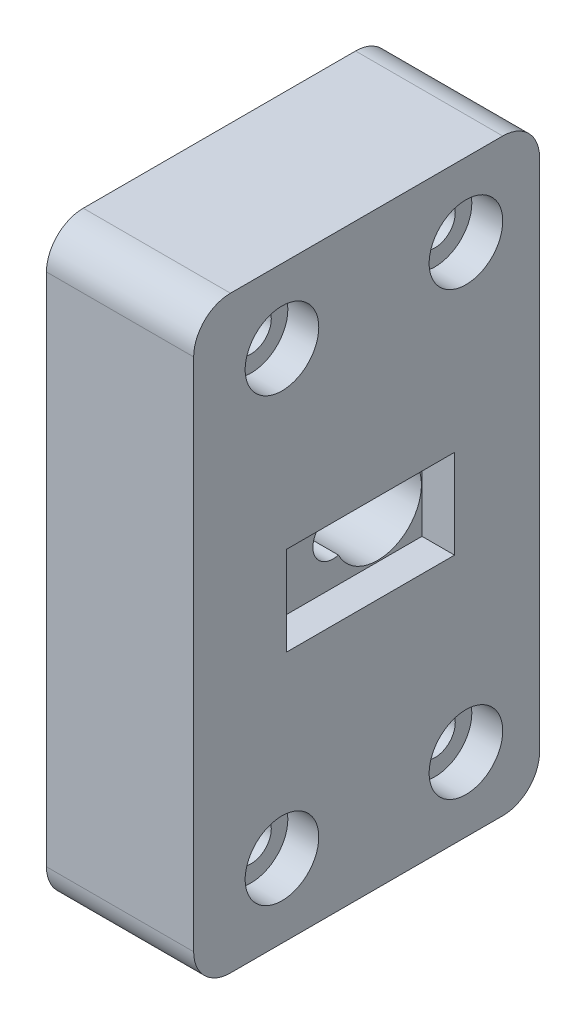
ISO-10303-21;
HEADER;
FILE_DESCRIPTION(('STEP AP214'),'2;1');
FILE_NAME('part.step','',(''),(''),'','','');
FILE_SCHEMA(('AUTOMOTIVE_DESIGN { 1 0 10303 214 1 1 1 1 }'));
ENDSEC;
DATA;
#1=APPLICATION_CONTEXT('core data for automotive mechanical design processes');
#2=APPLICATION_PROTOCOL_DEFINITION('international standard','automotive_design',2000,#1);
#3=PRODUCT_CONTEXT('',#1,'mechanical');
#4=PRODUCT('Part','Part','',(#3));
#5=PRODUCT_RELATED_PRODUCT_CATEGORY('part','',(#4));
#6=PRODUCT_DEFINITION_FORMATION('','',#4);
#7=PRODUCT_DEFINITION_CONTEXT('part definition',#1,'design');
#8=PRODUCT_DEFINITION('design','',#6,#7);
#9=PRODUCT_DEFINITION_SHAPE('','',#8);
#10=(LENGTH_UNIT() NAMED_UNIT(*) SI_UNIT(.MILLI.,.METRE.));
#11=(NAMED_UNIT(*) PLANE_ANGLE_UNIT() SI_UNIT($,.RADIAN.));
#12=(NAMED_UNIT(*) SI_UNIT($,.STERADIAN.) SOLID_ANGLE_UNIT());
#13=UNCERTAINTY_MEASURE_WITH_UNIT(LENGTH_MEASURE(1.E-05),#10,'distance_accuracy_value','');
#14=(GEOMETRIC_REPRESENTATION_CONTEXT(3) GLOBAL_UNCERTAINTY_ASSIGNED_CONTEXT((#13)) GLOBAL_UNIT_ASSIGNED_CONTEXT((#10,
#11,#12)) REPRESENTATION_CONTEXT('',''));
#15=CARTESIAN_POINT('',(0.,0.,0.));
#16=DIRECTION('',(0.,0.,1.));
#17=DIRECTION('',(1.,0.,0.));
#18=AXIS2_PLACEMENT_3D('',#15,#16,#17);
#19=CARTESIAN_POINT('',(0.,0.,47.));
#20=DIRECTION('',(1.,0.,0.));
#21=DIRECTION('',(0.,0.,-1.));
#22=AXIS2_PLACEMENT_3D('',#19,#20,#21);
#23=PLANE('',#22);
#24=CARTESIAN_POINT('',(0.,40.,17.5));
#25=DIRECTION('',(1.,0.,0.));
#26=DIRECTION('',(0.,0.,-1.));
#27=AXIS2_PLACEMENT_3D('',#24,#25,#26);
#28=CIRCLE('',#27,13.55);
#29=CARTESIAN_POINT('',(0.,40.,3.95000000000001));
#30=VERTEX_POINT('',#29);
#31=EDGE_CURVE('E11',#30,#30,#28,.T.);
#32=ORIENTED_EDGE('',*,*,#31,.T.);
#33=EDGE_LOOP('',(#32));
#34=FACE_BOUND('',#33,.T.);
#35=CARTESIAN_POINT('',(0.,70.,10.));
#36=DIRECTION('',(1.,0.,0.));
#37=DIRECTION('',(0.,0.,-1.));
#38=AXIS2_PLACEMENT_3D('',#35,#36,#37);
#39=CIRCLE('',#38,2.74999999999999);
#40=CARTESIAN_POINT('',(0.,70.,7.25000000000001));
#41=VERTEX_POINT('',#40);
#42=EDGE_CURVE('E186',#41,#41,#39,.T.);
#43=ORIENTED_EDGE('',*,*,#42,.T.);
#44=EDGE_LOOP('',(#43));
#45=FACE_BOUND('',#44,.T.);
#46=CARTESIAN_POINT('',(0.,70.,35.));
#47=DIRECTION('',(1.,0.,0.));
#48=DIRECTION('',(0.,0.,-1.));
#49=AXIS2_PLACEMENT_3D('',#46,#47,#48);
#50=CIRCLE('',#49,2.74999999999999);
#51=CARTESIAN_POINT('',(0.,70.,32.25));
#52=VERTEX_POINT('',#51);
#53=EDGE_CURVE('E198',#52,#52,#50,.T.);
#54=ORIENTED_EDGE('',*,*,#53,.T.);
#55=EDGE_LOOP('',(#54));
#56=FACE_BOUND('',#55,.T.);
#57=CARTESIAN_POINT('',(0.,10.,35.));
#58=DIRECTION('',(1.,0.,0.));
#59=DIRECTION('',(0.,0.,-1.));
#60=AXIS2_PLACEMENT_3D('',#57,#58,#59);
#61=CIRCLE('',#60,2.74999999999999);
#62=CARTESIAN_POINT('',(0.,10.,32.25));
#63=VERTEX_POINT('',#62);
#64=EDGE_CURVE('E210',#63,#63,#61,.T.);
#65=ORIENTED_EDGE('',*,*,#64,.T.);
#66=EDGE_LOOP('',(#65));
#67=FACE_BOUND('',#66,.T.);
#68=CARTESIAN_POINT('',(0.,10.,10.));
#69=DIRECTION('',(1.,0.,0.));
#70=DIRECTION('',(0.,0.,-1.));
#71=AXIS2_PLACEMENT_3D('',#68,#69,#70);
#72=CIRCLE('',#71,2.74999999999999);
#73=CARTESIAN_POINT('',(0.,10.,7.25000000000001));
#74=VERTEX_POINT('',#73);
#75=EDGE_CURVE('E222',#74,#74,#72,.T.);
#76=ORIENTED_EDGE('',*,*,#75,.T.);
#77=EDGE_LOOP('',(#76));
#78=FACE_BOUND('',#77,.T.);
#79=DIRECTION('',(0.,0.,-1.));
#80=VECTOR('',#79,1.);
#81=CARTESIAN_POINT('',(0.,0.,47.));
#82=LINE('',#81,#80);
#83=CARTESIAN_POINT('',(0.,0.,42.));
#84=VERTEX_POINT('',#83);
#85=CARTESIAN_POINT('',(0.,0.,5.));
#86=VERTEX_POINT('',#85);
#87=EDGE_CURVE('E259',#84,#86,#82,.T.);
#88=ORIENTED_EDGE('',*,*,#87,.F.);
#89=CARTESIAN_POINT('',(0.,5.,42.));
#90=DIRECTION('',(1.,0.,0.));
#91=DIRECTION('',(0.,0.,-1.));
#92=AXIS2_PLACEMENT_3D('',#89,#90,#91);
#93=CIRCLE('',#92,5.);
#94=CARTESIAN_POINT('',(0.,5.,47.));
#95=VERTEX_POINT('',#94);
#96=EDGE_CURVE('E287',#84,#95,#93,.F.);
#97=ORIENTED_EDGE('',*,*,#96,.T.);
#98=DIRECTION('',(0.,-1.,0.));
#99=VECTOR('',#98,1.);
#100=CARTESIAN_POINT('',(0.,0.,47.));
#101=LINE('',#100,#99);
#102=CARTESIAN_POINT('',(0.,75.,47.));
#103=VERTEX_POINT('',#102);
#104=EDGE_CURVE('E239',#103,#95,#101,.T.);
#105=ORIENTED_EDGE('',*,*,#104,.F.);
#106=CARTESIAN_POINT('',(0.,75.,42.));
#107=DIRECTION('',(1.,0.,0.));
#108=DIRECTION('',(0.,0.,-1.));
#109=AXIS2_PLACEMENT_3D('',#106,#107,#108);
#110=CIRCLE('',#109,5.);
#111=CARTESIAN_POINT('',(0.,80.,42.));
#112=VERTEX_POINT('',#111);
#113=EDGE_CURVE('E285',#103,#112,#110,.F.);
#114=ORIENTED_EDGE('',*,*,#113,.T.);
#115=DIRECTION('',(0.,0.,-1.));
#116=VECTOR('',#115,1.);
#117=CARTESIAN_POINT('',(0.,80.,47.));
#118=LINE('',#117,#116);
#119=CARTESIAN_POINT('',(0.,80.,5.));
#120=VERTEX_POINT('',#119);
#121=EDGE_CURVE('E246',#112,#120,#118,.T.);
#122=ORIENTED_EDGE('',*,*,#121,.T.);
#123=CARTESIAN_POINT('',(0.,75.,5.));
#124=DIRECTION('',(1.,0.,0.));
#125=DIRECTION('',(0.,0.,-1.));
#126=AXIS2_PLACEMENT_3D('',#123,#124,#125);
#127=CIRCLE('',#126,5.);
#128=CARTESIAN_POINT('',(0.,75.,0.));
#129=VERTEX_POINT('',#128);
#130=EDGE_CURVE('E283',#120,#129,#127,.F.);
#131=ORIENTED_EDGE('',*,*,#130,.T.);
#132=DIRECTION('',(0.,-1.,0.));
#133=VECTOR('',#132,1.);
#134=CARTESIAN_POINT('',(0.,0.,0.));
#135=LINE('',#134,#133);
#136=CARTESIAN_POINT('',(0.,5.,0.));
#137=VERTEX_POINT('',#136);
#138=EDGE_CURVE('E238',#129,#137,#135,.T.);
#139=ORIENTED_EDGE('',*,*,#138,.T.);
#140=CARTESIAN_POINT('',(0.,5.,5.));
#141=DIRECTION('',(1.,0.,0.));
#142=DIRECTION('',(0.,0.,-1.));
#143=AXIS2_PLACEMENT_3D('',#140,#141,#142);
#144=CIRCLE('',#143,5.);
#145=EDGE_CURVE('E281',#137,#86,#144,.F.);
#146=ORIENTED_EDGE('',*,*,#145,.T.);
#147=EDGE_LOOP('',(#88,#97,#105,#114,#122,#131,#139,#146));
#148=FACE_BOUND('',#147,.T.);
#149=ADVANCED_FACE('F36',(#34,#45,#56,#67,#78,#148),#23,.F.);
#150=CARTESIAN_POINT('',(0.,0.,47.));
#151=DIRECTION('',(0.,1.,0.));
#152=DIRECTION('',(0.,0.,1.));
#153=AXIS2_PLACEMENT_3D('',#150,#151,#152);
#154=PLANE('',#153);
#155=DIRECTION('',(0.,0.,-1.));
#156=VECTOR('',#155,1.);
#157=CARTESIAN_POINT('',(20.,0.,47.));
#158=LINE('',#157,#156);
#159=CARTESIAN_POINT('',(20.,0.,42.));
#160=VERTEX_POINT('',#159);
#161=CARTESIAN_POINT('',(20.,0.,5.));
#162=VERTEX_POINT('',#161);
#163=EDGE_CURVE('E256',#160,#162,#158,.T.);
#164=ORIENTED_EDGE('',*,*,#163,.F.);
#165=DIRECTION('',(1.,0.,0.));
#166=VECTOR('',#165,1.);
#167=CARTESIAN_POINT('',(0.,0.,42.));
#168=LINE('',#167,#166);
#169=EDGE_CURVE('E279',#160,#84,#168,.F.);
#170=ORIENTED_EDGE('',*,*,#169,.T.);
#171=ORIENTED_EDGE('',*,*,#87,.T.);
#172=DIRECTION('',(1.,0.,0.));
#173=VECTOR('',#172,1.);
#174=CARTESIAN_POINT('',(20.,0.,5.));
#175=LINE('',#174,#173);
#176=EDGE_CURVE('E276',#86,#162,#175,.T.);
#177=ORIENTED_EDGE('',*,*,#176,.T.);
#178=EDGE_LOOP('',(#164,#170,#171,#177));
#179=FACE_BOUND('',#178,.T.);
#180=ADVANCED_FACE('F313',(#179),#154,.F.);
#181=CARTESIAN_POINT('',(20.,0.,47.));
#182=DIRECTION('',(-1.,0.,0.));
#183=DIRECTION('',(0.,-1.,0.));
#184=AXIS2_PLACEMENT_3D('',#181,#182,#183);
#185=PLANE('',#184);
#186=CARTESIAN_POINT('',(20.,70.,10.));
#187=DIRECTION('',(1.,0.,0.));
#188=DIRECTION('',(0.,0.,-1.));
#189=AXIS2_PLACEMENT_3D('',#186,#187,#188);
#190=CIRCLE('',#189,4.99999999999999);
#191=CARTESIAN_POINT('',(20.,70.,5.00000000000001));
#192=VERTEX_POINT('',#191);
#193=EDGE_CURVE('E177',#192,#192,#190,.T.);
#194=ORIENTED_EDGE('',*,*,#193,.F.);
#195=EDGE_LOOP('',(#194));
#196=FACE_BOUND('',#195,.T.);
#197=CARTESIAN_POINT('',(20.,70.,35.));
#198=DIRECTION('',(1.,0.,0.));
#199=DIRECTION('',(0.,0.,-1.));
#200=AXIS2_PLACEMENT_3D('',#197,#198,#199);
#201=CIRCLE('',#200,4.99999999999999);
#202=CARTESIAN_POINT('',(20.,70.,30.));
#203=VERTEX_POINT('',#202);
#204=EDGE_CURVE('E189',#203,#203,#201,.T.);
#205=ORIENTED_EDGE('',*,*,#204,.F.);
#206=EDGE_LOOP('',(#205));
#207=FACE_BOUND('',#206,.T.);
#208=CARTESIAN_POINT('',(20.,10.,35.));
#209=DIRECTION('',(1.,0.,0.));
#210=DIRECTION('',(0.,0.,-1.));
#211=AXIS2_PLACEMENT_3D('',#208,#209,#210);
#212=CIRCLE('',#211,4.99999999999999);
#213=CARTESIAN_POINT('',(20.,10.,30.));
#214=VERTEX_POINT('',#213);
#215=EDGE_CURVE('E201',#214,#214,#212,.T.);
#216=ORIENTED_EDGE('',*,*,#215,.F.);
#217=EDGE_LOOP('',(#216));
#218=FACE_BOUND('',#217,.T.);
#219=CARTESIAN_POINT('',(20.,10.,10.));
#220=DIRECTION('',(1.,0.,0.));
#221=DIRECTION('',(0.,0.,-1.));
#222=AXIS2_PLACEMENT_3D('',#219,#220,#221);
#223=CIRCLE('',#222,4.99999999999999);
#224=CARTESIAN_POINT('',(20.,10.,5.00000000000001));
#225=VERTEX_POINT('',#224);
#226=EDGE_CURVE('E213',#225,#225,#223,.T.);
#227=ORIENTED_EDGE('',*,*,#226,.F.);
#228=EDGE_LOOP('',(#227));
#229=FACE_BOUND('',#228,.T.);
#230=DIRECTION('',(0.,0.,1.));
#231=VECTOR('',#230,1.);
#232=CARTESIAN_POINT('',(20.,46.05,11.55));
#233=LINE('',#232,#231);
#234=CARTESIAN_POINT('',(20.,46.05,11.55));
#235=VERTEX_POINT('',#234);
#236=CARTESIAN_POINT('',(20.,46.05,34.35));
#237=VERTEX_POINT('',#236);
#238=EDGE_CURVE('E149',#235,#237,#233,.T.);
#239=ORIENTED_EDGE('',*,*,#238,.F.);
#240=DIRECTION('',(0.,1.,0.));
#241=VECTOR('',#240,1.);
#242=CARTESIAN_POINT('',(20.,46.05,11.55));
#243=LINE('',#242,#241);
#244=CARTESIAN_POINT('',(20.,33.95,11.55));
#245=VERTEX_POINT('',#244);
#246=EDGE_CURVE('E152',#245,#235,#243,.T.);
#247=ORIENTED_EDGE('',*,*,#246,.F.);
#248=DIRECTION('',(0.,0.,-1.));
#249=VECTOR('',#248,1.);
#250=CARTESIAN_POINT('',(20.,33.95,11.55));
#251=LINE('',#250,#249);
#252=CARTESIAN_POINT('',(20.,33.95,34.35));
#253=VERTEX_POINT('',#252);
#254=EDGE_CURVE('E157',#253,#245,#251,.T.);
#255=ORIENTED_EDGE('',*,*,#254,.F.);
#256=DIRECTION('',(0.,-1.,0.));
#257=VECTOR('',#256,1.);
#258=CARTESIAN_POINT('',(20.,46.05,34.35));
#259=LINE('',#258,#257);
#260=EDGE_CURVE('E141',#237,#253,#259,.T.);
#261=ORIENTED_EDGE('',*,*,#260,.F.);
#262=EDGE_LOOP('',(#239,#247,#255,#261));
#263=FACE_BOUND('',#262,.T.);
#264=DIRECTION('',(0.,1.,0.));
#265=VECTOR('',#264,1.);
#266=CARTESIAN_POINT('',(20.,0.,47.));
#267=LINE('',#266,#265);
#268=CARTESIAN_POINT('',(20.,5.,47.));
#269=VERTEX_POINT('',#268);
#270=CARTESIAN_POINT('',(20.,75.,47.));
#271=VERTEX_POINT('',#270);
#272=EDGE_CURVE('E242',#269,#271,#267,.T.);
#273=ORIENTED_EDGE('',*,*,#272,.F.);
#274=CARTESIAN_POINT('',(20.,5.,42.));
#275=DIRECTION('',(-1.,0.,0.));
#276=DIRECTION('',(0.,-1.,0.));
#277=AXIS2_PLACEMENT_3D('',#274,#275,#276);
#278=CIRCLE('',#277,5.);
#279=EDGE_CURVE('E274',#269,#160,#278,.F.);
#280=ORIENTED_EDGE('',*,*,#279,.T.);
#281=ORIENTED_EDGE('',*,*,#163,.T.);
#282=CARTESIAN_POINT('',(20.,5.,5.));
#283=DIRECTION('',(-1.,0.,0.));
#284=DIRECTION('',(0.,-1.,0.));
#285=AXIS2_PLACEMENT_3D('',#282,#283,#284);
#286=CIRCLE('',#285,5.);
#287=CARTESIAN_POINT('',(20.,5.,0.));
#288=VERTEX_POINT('',#287);
#289=EDGE_CURVE('E268',#162,#288,#286,.F.);
#290=ORIENTED_EDGE('',*,*,#289,.T.);
#291=DIRECTION('',(0.,1.,0.));
#292=VECTOR('',#291,1.);
#293=CARTESIAN_POINT('',(20.,0.,0.));
#294=LINE('',#293,#292);
#295=CARTESIAN_POINT('',(20.,75.,0.));
#296=VERTEX_POINT('',#295);
#297=EDGE_CURVE('E243',#288,#296,#294,.T.);
#298=ORIENTED_EDGE('',*,*,#297,.T.);
#299=CARTESIAN_POINT('',(20.,75.,5.));
#300=DIRECTION('',(-1.,0.,0.));
#301=DIRECTION('',(0.,-1.,0.));
#302=AXIS2_PLACEMENT_3D('',#299,#300,#301);
#303=CIRCLE('',#302,5.);
#304=CARTESIAN_POINT('',(20.,80.,5.));
#305=VERTEX_POINT('',#304);
#306=EDGE_CURVE('E270',#296,#305,#303,.F.);
#307=ORIENTED_EDGE('',*,*,#306,.T.);
#308=DIRECTION('',(0.,0.,-1.));
#309=VECTOR('',#308,1.);
#310=CARTESIAN_POINT('',(20.,80.,47.));
#311=LINE('',#310,#309);
#312=CARTESIAN_POINT('',(20.,80.,42.));
#313=VERTEX_POINT('',#312);
#314=EDGE_CURVE('E253',#313,#305,#311,.T.);
#315=ORIENTED_EDGE('',*,*,#314,.F.);
#316=CARTESIAN_POINT('',(20.,75.,42.));
#317=DIRECTION('',(-1.,0.,0.));
#318=DIRECTION('',(0.,-1.,0.));
#319=AXIS2_PLACEMENT_3D('',#316,#317,#318);
#320=CIRCLE('',#319,5.);
#321=EDGE_CURVE('E272',#313,#271,#320,.F.);
#322=ORIENTED_EDGE('',*,*,#321,.T.);
#323=EDGE_LOOP('',(#273,#280,#281,#290,#298,#307,#315,#322));
#324=FACE_BOUND('',#323,.T.);
#325=ADVANCED_FACE('F154',(#196,#207,#218,#229,#263,#324),#185,.F.);
#326=CARTESIAN_POINT('',(0.,80.,47.));
#327=DIRECTION('',(0.,-1.,0.));
#328=DIRECTION('',(0.,0.,-1.));
#329=AXIS2_PLACEMENT_3D('',#326,#327,#328);
#330=PLANE('',#329);
#331=ORIENTED_EDGE('',*,*,#121,.F.);
#332=DIRECTION('',(-1.,0.,0.));
#333=VECTOR('',#332,1.);
#334=CARTESIAN_POINT('',(0.,80.,42.));
#335=LINE('',#334,#333);
#336=EDGE_CURVE('E292',#112,#313,#335,.F.);
#337=ORIENTED_EDGE('',*,*,#336,.T.);
#338=ORIENTED_EDGE('',*,*,#314,.T.);
#339=DIRECTION('',(-1.,0.,0.));
#340=VECTOR('',#339,1.);
#341=CARTESIAN_POINT('',(0.,80.,5.));
#342=LINE('',#341,#340);
#343=EDGE_CURVE('E289',#305,#120,#342,.T.);
#344=ORIENTED_EDGE('',*,*,#343,.T.);
#345=EDGE_LOOP('',(#331,#337,#338,#344));
#346=FACE_BOUND('',#345,.T.);
#347=ADVANCED_FACE('F365',(#346),#330,.F.);
#348=CARTESIAN_POINT('',(0.,0.,47.));
#349=DIRECTION('',(0.,0.,-1.));
#350=DIRECTION('',(-1.,0.,0.));
#351=AXIS2_PLACEMENT_3D('',#348,#349,#350);
#352=PLANE('',#351);
#353=ORIENTED_EDGE('',*,*,#104,.T.);
#354=DIRECTION('',(1.,0.,0.));
#355=VECTOR('',#354,1.);
#356=CARTESIAN_POINT('',(0.,5.,47.));
#357=LINE('',#356,#355);
#358=EDGE_CURVE('E265',#95,#269,#357,.T.);
#359=ORIENTED_EDGE('',*,*,#358,.T.);
#360=ORIENTED_EDGE('',*,*,#272,.T.);
#361=DIRECTION('',(-1.,0.,0.));
#362=VECTOR('',#361,1.);
#363=CARTESIAN_POINT('',(0.,75.,47.));
#364=LINE('',#363,#362);
#365=EDGE_CURVE('E262',#271,#103,#364,.T.);
#366=ORIENTED_EDGE('',*,*,#365,.T.);
#367=EDGE_LOOP('',(#353,#359,#360,#366));
#368=FACE_BOUND('',#367,.T.);
#369=ADVANCED_FACE('F358',(#368),#352,.F.);
#370=CARTESIAN_POINT('',(0.,0.,0.));
#371=DIRECTION('',(0.,0.,-1.));
#372=DIRECTION('',(-1.,0.,0.));
#373=AXIS2_PLACEMENT_3D('',#370,#371,#372);
#374=PLANE('',#373);
#375=ORIENTED_EDGE('',*,*,#138,.F.);
#376=DIRECTION('',(-1.,0.,0.));
#377=VECTOR('',#376,1.);
#378=CARTESIAN_POINT('',(20.,75.,0.));
#379=LINE('',#378,#377);
#380=EDGE_CURVE('E296',#129,#296,#379,.F.);
#381=ORIENTED_EDGE('',*,*,#380,.T.);
#382=ORIENTED_EDGE('',*,*,#297,.F.);
#383=DIRECTION('',(1.,0.,0.));
#384=VECTOR('',#383,1.);
#385=CARTESIAN_POINT('',(0.,5.,0.));
#386=LINE('',#385,#384);
#387=EDGE_CURVE('E294',#288,#137,#386,.F.);
#388=ORIENTED_EDGE('',*,*,#387,.T.);
#389=EDGE_LOOP('',(#375,#381,#382,#388));
#390=FACE_BOUND('',#389,.T.);
#391=ADVANCED_FACE('F371',(#390),#374,.T.);
#392=CARTESIAN_POINT('',(8.,40.,17.5));
#393=DIRECTION('',(-1.,0.,0.));
#394=DIRECTION('',(0.,0.,1.));
#395=AXIS2_PLACEMENT_3D('',#392,#393,#394);
#396=CYLINDRICAL_SURFACE('',#395,13.05);
#397=CARTESIAN_POINT('',(0.499999999999997,40.,17.5));
#398=DIRECTION('',(1.,0.,0.));
#399=DIRECTION('',(0.,0.,-1.));
#400=AXIS2_PLACEMENT_3D('',#397,#398,#399);
#401=CIRCLE('',#400,13.05);
#402=CARTESIAN_POINT('',(0.499999999999997,40.,4.45));
#403=VERTEX_POINT('',#402);
#404=EDGE_CURVE('E44',#403,#403,#401,.F.);
#405=ORIENTED_EDGE('',*,*,#404,.T.);
#406=EDGE_LOOP('',(#405));
#407=FACE_BOUND('',#406,.T.);
#408=CARTESIAN_POINT('',(8.,40.,17.5));
#409=DIRECTION('',(-1.,0.,0.));
#410=DIRECTION('',(0.,0.,1.));
#411=AXIS2_PLACEMENT_3D('',#408,#409,#410);
#412=CIRCLE('',#411,13.05);
#413=CARTESIAN_POINT('',(8.,40.,30.55));
#414=VERTEX_POINT('',#413);
#415=EDGE_CURVE('E234',#414,#414,#412,.T.);
#416=ORIENTED_EDGE('',*,*,#415,.F.);
#417=EDGE_LOOP('',(#416));
#418=FACE_BOUND('',#417,.T.);
#419=ADVANCED_FACE('F302',(#407,#418),#396,.F.);
#420=CARTESIAN_POINT('',(8.,40.,17.5));
#421=DIRECTION('',(-1.,0.,0.));
#422=DIRECTION('',(0.,0.,1.));
#423=AXIS2_PLACEMENT_3D('',#420,#421,#422);
#424=PLANE('',#423);
#425=CARTESIAN_POINT('',(8.,40.,23.55));
#426=DIRECTION('',(-1.,0.,0.));
#427=DIRECTION('',(0.,0.,1.));
#428=AXIS2_PLACEMENT_3D('',#425,#426,#427);
#429=CIRCLE('',#428,2.75);
#430=CARTESIAN_POINT('',(8.,37.3470633886024,22.825826446281));
#431=VERTEX_POINT('',#430);
#432=CARTESIAN_POINT('',(8.,42.6529366113976,22.825826446281));
#433=VERTEX_POINT('',#432);
#434=EDGE_CURVE('E225',#431,#433,#429,.T.);
#435=ORIENTED_EDGE('',*,*,#434,.F.);
#436=CARTESIAN_POINT('',(8.,40.,17.5));
#437=DIRECTION('',(-1.,0.,0.));
#438=DIRECTION('',(0.,0.,1.));
#439=AXIS2_PLACEMENT_3D('',#436,#437,#438);
#440=CIRCLE('',#439,5.95);
#441=EDGE_CURVE('E228',#433,#431,#440,.T.);
#442=ORIENTED_EDGE('',*,*,#441,.F.);
#443=EDGE_LOOP('',(#435,#442));
#444=FACE_BOUND('',#443,.T.);
#445=ORIENTED_EDGE('',*,*,#415,.T.);
#446=EDGE_LOOP('',(#445));
#447=FACE_BOUND('',#446,.T.);
#448=ADVANCED_FACE('F388',(#444,#447),#424,.T.);
#449=CARTESIAN_POINT('',(20.001,40.,23.55));
#450=DIRECTION('',(-1.,0.,0.));
#451=DIRECTION('',(0.,0.,1.));
#452=AXIS2_PLACEMENT_3D('',#449,#450,#451);
#453=CYLINDRICAL_SURFACE('',#452,2.75);
#454=DIRECTION('',(-1.,0.,0.));
#455=VECTOR('',#454,1.);
#456=CARTESIAN_POINT('',(20.001,42.6529366113976,22.825826446281));
#457=LINE('',#456,#455);
#458=CARTESIAN_POINT('',(15.5,42.6529366113976,22.825826446281));
#459=VERTEX_POINT('',#458);
#460=EDGE_CURVE('E231',#459,#433,#457,.T.);
#461=ORIENTED_EDGE('',*,*,#460,.F.);
#462=CARTESIAN_POINT('',(15.5,40.,23.55));
#463=DIRECTION('',(-1.,0.,0.));
#464=DIRECTION('',(0.,-1.,0.));
#465=AXIS2_PLACEMENT_3D('',#462,#463,#464);
#466=CIRCLE('',#465,2.75);
#467=CARTESIAN_POINT('',(15.5,37.3470633886024,22.825826446281));
#468=VERTEX_POINT('',#467);
#469=EDGE_CURVE('E58',#459,#468,#466,.F.);
#470=ORIENTED_EDGE('',*,*,#469,.T.);
#471=DIRECTION('',(-1.,0.,0.));
#472=VECTOR('',#471,1.);
#473=CARTESIAN_POINT('',(20.001,37.3470633886024,22.825826446281));
#474=LINE('',#473,#472);
#475=EDGE_CURVE('E232',#468,#431,#474,.T.);
#476=ORIENTED_EDGE('',*,*,#475,.T.);
#477=ORIENTED_EDGE('',*,*,#434,.T.);
#478=EDGE_LOOP('',(#461,#470,#476,#477));
#479=FACE_BOUND('',#478,.T.);
#480=ADVANCED_FACE('F391',(#479),#453,.F.);
#481=CARTESIAN_POINT('',(20.001,40.,17.5));
#482=DIRECTION('',(-1.,0.,0.));
#483=DIRECTION('',(0.,0.,1.));
#484=AXIS2_PLACEMENT_3D('',#481,#482,#483);
#485=CYLINDRICAL_SURFACE('',#484,5.95);
#486=ORIENTED_EDGE('',*,*,#475,.F.);
#487=CARTESIAN_POINT('',(15.5,40.,17.5));
#488=DIRECTION('',(-1.,0.,0.));
#489=DIRECTION('',(0.,-1.,0.));
#490=AXIS2_PLACEMENT_3D('',#487,#488,#489);
#491=CIRCLE('',#490,5.95);
#492=EDGE_CURVE('E298',#468,#459,#491,.F.);
#493=ORIENTED_EDGE('',*,*,#492,.T.);
#494=ORIENTED_EDGE('',*,*,#460,.T.);
#495=ORIENTED_EDGE('',*,*,#441,.T.);
#496=EDGE_LOOP('',(#486,#493,#494,#495));
#497=FACE_BOUND('',#496,.T.);
#498=ADVANCED_FACE('F395',(#497),#485,.F.);
#499=CARTESIAN_POINT('',(20.,10.,10.));
#500=DIRECTION('',(1.,0.,0.));
#501=DIRECTION('',(0.,0.,-1.));
#502=AXIS2_PLACEMENT_3D('',#499,#500,#501);
#503=CYLINDRICAL_SURFACE('',#502,2.75);
#504=ORIENTED_EDGE('',*,*,#75,.F.);
#505=EDGE_LOOP('',(#504));
#506=FACE_BOUND('',#505,.T.);
#507=CARTESIAN_POINT('',(15.8,10.,10.));
#508=DIRECTION('',(1.,0.,0.));
#509=DIRECTION('',(0.,0.,-1.));
#510=AXIS2_PLACEMENT_3D('',#507,#508,#509);
#511=CIRCLE('',#510,2.75);
#512=CARTESIAN_POINT('',(15.8,10.,7.25));
#513=VERTEX_POINT('',#512);
#514=EDGE_CURVE('E219',#513,#513,#511,.T.);
#515=ORIENTED_EDGE('',*,*,#514,.T.);
#516=EDGE_LOOP('',(#515));
#517=FACE_BOUND('',#516,.T.);
#518=ADVANCED_FACE('F399',(#506,#517),#503,.F.);
#519=CARTESIAN_POINT('',(15.8,12.75,10.));
#520=DIRECTION('',(-1.,0.,0.));
#521=DIRECTION('',(0.,0.,1.));
#522=AXIS2_PLACEMENT_3D('',#519,#520,#521);
#523=PLANE('',#522);
#524=ORIENTED_EDGE('',*,*,#514,.F.);
#525=EDGE_LOOP('',(#524));
#526=FACE_BOUND('',#525,.T.);
#527=CARTESIAN_POINT('',(15.8,10.,10.));
#528=DIRECTION('',(1.,0.,0.));
#529=DIRECTION('',(0.,0.,-1.));
#530=AXIS2_PLACEMENT_3D('',#527,#528,#529);
#531=CIRCLE('',#530,5.);
#532=CARTESIAN_POINT('',(15.8,10.,5.));
#533=VERTEX_POINT('',#532);
#534=EDGE_CURVE('E216',#533,#533,#531,.T.);
#535=ORIENTED_EDGE('',*,*,#534,.T.);
#536=EDGE_LOOP('',(#535));
#537=FACE_BOUND('',#536,.T.);
#538=ADVANCED_FACE('F403',(#526,#537),#523,.F.);
#539=CARTESIAN_POINT('',(20.,10.,10.));
#540=DIRECTION('',(1.,0.,0.));
#541=DIRECTION('',(0.,0.,-1.));
#542=AXIS2_PLACEMENT_3D('',#539,#540,#541);
#543=CYLINDRICAL_SURFACE('',#542,5.);
#544=ORIENTED_EDGE('',*,*,#534,.F.);
#545=EDGE_LOOP('',(#544));
#546=FACE_BOUND('',#545,.T.);
#547=ORIENTED_EDGE('',*,*,#226,.T.);
#548=EDGE_LOOP('',(#547));
#549=FACE_BOUND('',#548,.T.);
#550=ADVANCED_FACE('F407',(#546,#549),#543,.F.);
#551=CARTESIAN_POINT('',(20.,10.,35.));
#552=DIRECTION('',(1.,0.,0.));
#553=DIRECTION('',(0.,0.,-1.));
#554=AXIS2_PLACEMENT_3D('',#551,#552,#553);
#555=CYLINDRICAL_SURFACE('',#554,2.75);
#556=ORIENTED_EDGE('',*,*,#64,.F.);
#557=EDGE_LOOP('',(#556));
#558=FACE_BOUND('',#557,.T.);
#559=CARTESIAN_POINT('',(15.8,10.,35.));
#560=DIRECTION('',(1.,0.,0.));
#561=DIRECTION('',(0.,0.,-1.));
#562=AXIS2_PLACEMENT_3D('',#559,#560,#561);
#563=CIRCLE('',#562,2.75);
#564=CARTESIAN_POINT('',(15.8,10.,32.25));
#565=VERTEX_POINT('',#564);
#566=EDGE_CURVE('E207',#565,#565,#563,.T.);
#567=ORIENTED_EDGE('',*,*,#566,.T.);
#568=EDGE_LOOP('',(#567));
#569=FACE_BOUND('',#568,.T.);
#570=ADVANCED_FACE('F411',(#558,#569),#555,.F.);
#571=CARTESIAN_POINT('',(15.8,12.75,35.));
#572=DIRECTION('',(-1.,0.,0.));
#573=DIRECTION('',(0.,0.,1.));
#574=AXIS2_PLACEMENT_3D('',#571,#572,#573);
#575=PLANE('',#574);
#576=ORIENTED_EDGE('',*,*,#566,.F.);
#577=EDGE_LOOP('',(#576));
#578=FACE_BOUND('',#577,.T.);
#579=CARTESIAN_POINT('',(15.8,10.,35.));
#580=DIRECTION('',(1.,0.,0.));
#581=DIRECTION('',(0.,0.,-1.));
#582=AXIS2_PLACEMENT_3D('',#579,#580,#581);
#583=CIRCLE('',#582,5.);
#584=CARTESIAN_POINT('',(15.8,10.,30.));
#585=VERTEX_POINT('',#584);
#586=EDGE_CURVE('E204',#585,#585,#583,.T.);
#587=ORIENTED_EDGE('',*,*,#586,.T.);
#588=EDGE_LOOP('',(#587));
#589=FACE_BOUND('',#588,.T.);
#590=ADVANCED_FACE('F415',(#578,#589),#575,.F.);
#591=CARTESIAN_POINT('',(20.,10.,35.));
#592=DIRECTION('',(1.,0.,0.));
#593=DIRECTION('',(0.,0.,-1.));
#594=AXIS2_PLACEMENT_3D('',#591,#592,#593);
#595=CYLINDRICAL_SURFACE('',#594,5.);
#596=ORIENTED_EDGE('',*,*,#586,.F.);
#597=EDGE_LOOP('',(#596));
#598=FACE_BOUND('',#597,.T.);
#599=ORIENTED_EDGE('',*,*,#215,.T.);
#600=EDGE_LOOP('',(#599));
#601=FACE_BOUND('',#600,.T.);
#602=ADVANCED_FACE('F419',(#598,#601),#595,.F.);
#603=CARTESIAN_POINT('',(20.,70.,35.));
#604=DIRECTION('',(1.,0.,0.));
#605=DIRECTION('',(0.,0.,-1.));
#606=AXIS2_PLACEMENT_3D('',#603,#604,#605);
#607=CYLINDRICAL_SURFACE('',#606,2.75);
#608=ORIENTED_EDGE('',*,*,#53,.F.);
#609=EDGE_LOOP('',(#608));
#610=FACE_BOUND('',#609,.T.);
#611=CARTESIAN_POINT('',(15.8,70.,35.));
#612=DIRECTION('',(1.,0.,0.));
#613=DIRECTION('',(0.,0.,-1.));
#614=AXIS2_PLACEMENT_3D('',#611,#612,#613);
#615=CIRCLE('',#614,2.75);
#616=CARTESIAN_POINT('',(15.8,70.,32.25));
#617=VERTEX_POINT('',#616);
#618=EDGE_CURVE('E195',#617,#617,#615,.T.);
#619=ORIENTED_EDGE('',*,*,#618,.T.);
#620=EDGE_LOOP('',(#619));
#621=FACE_BOUND('',#620,.T.);
#622=ADVANCED_FACE('F423',(#610,#621),#607,.F.);
#623=CARTESIAN_POINT('',(15.8,72.75,35.));
#624=DIRECTION('',(-1.,0.,0.));
#625=DIRECTION('',(0.,0.,1.));
#626=AXIS2_PLACEMENT_3D('',#623,#624,#625);
#627=PLANE('',#626);
#628=ORIENTED_EDGE('',*,*,#618,.F.);
#629=EDGE_LOOP('',(#628));
#630=FACE_BOUND('',#629,.T.);
#631=CARTESIAN_POINT('',(15.8,70.,35.));
#632=DIRECTION('',(1.,0.,0.));
#633=DIRECTION('',(0.,0.,-1.));
#634=AXIS2_PLACEMENT_3D('',#631,#632,#633);
#635=CIRCLE('',#634,5.);
#636=CARTESIAN_POINT('',(15.8,70.,30.));
#637=VERTEX_POINT('',#636);
#638=EDGE_CURVE('E192',#637,#637,#635,.T.);
#639=ORIENTED_EDGE('',*,*,#638,.T.);
#640=EDGE_LOOP('',(#639));
#641=FACE_BOUND('',#640,.T.);
#642=ADVANCED_FACE('F427',(#630,#641),#627,.F.);
#643=CARTESIAN_POINT('',(20.,70.,35.));
#644=DIRECTION('',(1.,0.,0.));
#645=DIRECTION('',(0.,0.,-1.));
#646=AXIS2_PLACEMENT_3D('',#643,#644,#645);
#647=CYLINDRICAL_SURFACE('',#646,5.);
#648=ORIENTED_EDGE('',*,*,#638,.F.);
#649=EDGE_LOOP('',(#648));
#650=FACE_BOUND('',#649,.T.);
#651=ORIENTED_EDGE('',*,*,#204,.T.);
#652=EDGE_LOOP('',(#651));
#653=FACE_BOUND('',#652,.T.);
#654=ADVANCED_FACE('F431',(#650,#653),#647,.F.);
#655=CARTESIAN_POINT('',(20.,70.,10.));
#656=DIRECTION('',(1.,0.,0.));
#657=DIRECTION('',(0.,0.,-1.));
#658=AXIS2_PLACEMENT_3D('',#655,#656,#657);
#659=CYLINDRICAL_SURFACE('',#658,2.75);
#660=ORIENTED_EDGE('',*,*,#42,.F.);
#661=EDGE_LOOP('',(#660));
#662=FACE_BOUND('',#661,.T.);
#663=CARTESIAN_POINT('',(15.8,70.,10.));
#664=DIRECTION('',(1.,0.,0.));
#665=DIRECTION('',(0.,0.,-1.));
#666=AXIS2_PLACEMENT_3D('',#663,#664,#665);
#667=CIRCLE('',#666,2.75);
#668=CARTESIAN_POINT('',(15.8,70.,7.25));
#669=VERTEX_POINT('',#668);
#670=EDGE_CURVE('E183',#669,#669,#667,.T.);
#671=ORIENTED_EDGE('',*,*,#670,.T.);
#672=EDGE_LOOP('',(#671));
#673=FACE_BOUND('',#672,.T.);
#674=ADVANCED_FACE('F435',(#662,#673),#659,.F.);
#675=CARTESIAN_POINT('',(15.8,72.75,10.));
#676=DIRECTION('',(-1.,0.,0.));
#677=DIRECTION('',(0.,0.,1.));
#678=AXIS2_PLACEMENT_3D('',#675,#676,#677);
#679=PLANE('',#678);
#680=ORIENTED_EDGE('',*,*,#670,.F.);
#681=EDGE_LOOP('',(#680));
#682=FACE_BOUND('',#681,.T.);
#683=CARTESIAN_POINT('',(15.8,70.,10.));
#684=DIRECTION('',(1.,0.,0.));
#685=DIRECTION('',(0.,0.,-1.));
#686=AXIS2_PLACEMENT_3D('',#683,#684,#685);
#687=CIRCLE('',#686,5.);
#688=CARTESIAN_POINT('',(15.8,70.,5.));
#689=VERTEX_POINT('',#688);
#690=EDGE_CURVE('E180',#689,#689,#687,.T.);
#691=ORIENTED_EDGE('',*,*,#690,.T.);
#692=EDGE_LOOP('',(#691));
#693=FACE_BOUND('',#692,.T.);
#694=ADVANCED_FACE('F439',(#682,#693),#679,.F.);
#695=CARTESIAN_POINT('',(20.,70.,10.));
#696=DIRECTION('',(1.,0.,0.));
#697=DIRECTION('',(0.,0.,-1.));
#698=AXIS2_PLACEMENT_3D('',#695,#696,#697);
#699=CYLINDRICAL_SURFACE('',#698,5.);
#700=ORIENTED_EDGE('',*,*,#690,.F.);
#701=EDGE_LOOP('',(#700));
#702=FACE_BOUND('',#701,.T.);
#703=ORIENTED_EDGE('',*,*,#193,.T.);
#704=EDGE_LOOP('',(#703));
#705=FACE_BOUND('',#704,.T.);
#706=ADVANCED_FACE('F328',(#702,#705),#699,.F.);
#707=CARTESIAN_POINT('',(0.,5.,42.));
#708=DIRECTION('',(1.,0.,0.));
#709=DIRECTION('',(0.,0.,-1.));
#710=AXIS2_PLACEMENT_3D('',#707,#708,#709);
#711=CYLINDRICAL_SURFACE('',#710,5.);
#712=ORIENTED_EDGE('',*,*,#96,.F.);
#713=ORIENTED_EDGE('',*,*,#169,.F.);
#714=ORIENTED_EDGE('',*,*,#279,.F.);
#715=ORIENTED_EDGE('',*,*,#358,.F.);
#716=EDGE_LOOP('',(#712,#713,#714,#715));
#717=FACE_BOUND('',#716,.T.);
#718=ADVANCED_FACE('F324',(#717),#711,.T.);
#719=CARTESIAN_POINT('',(0.,75.,42.));
#720=DIRECTION('',(-1.,0.,0.));
#721=DIRECTION('',(0.,0.,1.));
#722=AXIS2_PLACEMENT_3D('',#719,#720,#721);
#723=CYLINDRICAL_SURFACE('',#722,5.);
#724=ORIENTED_EDGE('',*,*,#321,.F.);
#725=ORIENTED_EDGE('',*,*,#336,.F.);
#726=ORIENTED_EDGE('',*,*,#113,.F.);
#727=ORIENTED_EDGE('',*,*,#365,.F.);
#728=EDGE_LOOP('',(#724,#725,#726,#727));
#729=FACE_BOUND('',#728,.T.);
#730=ADVANCED_FACE('F327',(#729),#723,.T.);
#731=CARTESIAN_POINT('',(0.,75.,5.));
#732=DIRECTION('',(1.,0.,0.));
#733=DIRECTION('',(0.,0.,-1.));
#734=AXIS2_PLACEMENT_3D('',#731,#732,#733);
#735=CYLINDRICAL_SURFACE('',#734,5.);
#736=ORIENTED_EDGE('',*,*,#306,.F.);
#737=ORIENTED_EDGE('',*,*,#380,.F.);
#738=ORIENTED_EDGE('',*,*,#130,.F.);
#739=ORIENTED_EDGE('',*,*,#343,.F.);
#740=EDGE_LOOP('',(#736,#737,#738,#739));
#741=FACE_BOUND('',#740,.T.);
#742=ADVANCED_FACE('F332',(#741),#735,.T.);
#743=CARTESIAN_POINT('',(0.,5.,5.));
#744=DIRECTION('',(-1.,0.,0.));
#745=DIRECTION('',(0.,0.,1.));
#746=AXIS2_PLACEMENT_3D('',#743,#744,#745);
#747=CYLINDRICAL_SURFACE('',#746,5.);
#748=ORIENTED_EDGE('',*,*,#145,.F.);
#749=ORIENTED_EDGE('',*,*,#387,.F.);
#750=ORIENTED_EDGE('',*,*,#289,.F.);
#751=ORIENTED_EDGE('',*,*,#176,.F.);
#752=EDGE_LOOP('',(#748,#749,#750,#751));
#753=FACE_BOUND('',#752,.T.);
#754=ADVANCED_FACE('F335',(#753),#747,.T.);
#755=CARTESIAN_POINT('',(15.5,0.,0.));
#756=DIRECTION('',(-1.,0.,0.));
#757=DIRECTION('',(0.,-1.,0.));
#758=AXIS2_PLACEMENT_3D('',#755,#756,#757);
#759=PLANE('',#758);
#760=DIRECTION('',(0.,1.,0.));
#761=VECTOR('',#760,1.);
#762=CARTESIAN_POINT('',(15.5,46.05,11.471452207823));
#763=LINE('',#762,#761);
#764=CARTESIAN_POINT('',(15.5,33.871452207823,11.471452207823));
#765=VERTEX_POINT('',#764);
#766=CARTESIAN_POINT('',(15.5,46.128547792177,11.471452207823));
#767=VERTEX_POINT('',#766);
#768=EDGE_CURVE('E159',#765,#767,#763,.T.);
#769=ORIENTED_EDGE('',*,*,#768,.T.);
#770=DIRECTION('',(0.,0.,1.));
#771=VECTOR('',#770,1.);
#772=CARTESIAN_POINT('',(15.5,46.128547792177,11.55));
#773=LINE('',#772,#771);
#774=CARTESIAN_POINT('',(15.5,46.128547792177,34.428547792177));
#775=VERTEX_POINT('',#774);
#776=EDGE_CURVE('E171',#767,#775,#773,.T.);
#777=ORIENTED_EDGE('',*,*,#776,.T.);
#778=DIRECTION('',(0.,-1.,0.));
#779=VECTOR('',#778,1.);
#780=CARTESIAN_POINT('',(15.5,46.05,34.428547792177));
#781=LINE('',#780,#779);
#782=CARTESIAN_POINT('',(15.5,33.871452207823,34.428547792177));
#783=VERTEX_POINT('',#782);
#784=EDGE_CURVE('E144',#775,#783,#781,.T.);
#785=ORIENTED_EDGE('',*,*,#784,.T.);
#786=DIRECTION('',(0.,0.,-1.));
#787=VECTOR('',#786,1.);
#788=CARTESIAN_POINT('',(15.5,33.871452207823,11.55));
#789=LINE('',#788,#787);
#790=EDGE_CURVE('E166',#783,#765,#789,.T.);
#791=ORIENTED_EDGE('',*,*,#790,.T.);
#792=EDGE_LOOP('',(#769,#777,#785,#791));
#793=FACE_BOUND('',#792,.T.);
#794=ORIENTED_EDGE('',*,*,#492,.F.);
#795=ORIENTED_EDGE('',*,*,#469,.F.);
#796=EDGE_LOOP('',(#794,#795));
#797=FACE_BOUND('',#796,.T.);
#798=ADVANCED_FACE('F338',(#793,#797),#759,.F.);
#799=CARTESIAN_POINT('',(20.,46.05,11.55));
#800=DIRECTION('',(0.0174524064372835,0.,-0.999847695156391));
#801=DIRECTION('',(-0.999847695156391,0.,-0.0174524064372835));
#802=AXIS2_PLACEMENT_3D('',#799,#800,#801);
#803=PLANE('',#802);
#804=DIRECTION('',(0.999695459881887,0.0174497491606828,0.0174497491606827));
#805=VECTOR('',#804,1.);
#806=CARTESIAN_POINT('',(20.,33.95,11.55));
#807=LINE('',#806,#805);
#808=EDGE_CURVE('E163',#765,#245,#807,.T.);
#809=ORIENTED_EDGE('',*,*,#808,.T.);
#810=ORIENTED_EDGE('',*,*,#246,.T.);
#811=DIRECTION('',(0.999695459881887,-0.0174497491606827,0.0174497491606827));
#812=VECTOR('',#811,1.);
#813=CARTESIAN_POINT('',(20.,46.05,11.55));
#814=LINE('',#813,#812);
#815=EDGE_CURVE('E51',#767,#235,#814,.T.);
#816=ORIENTED_EDGE('',*,*,#815,.F.);
#817=ORIENTED_EDGE('',*,*,#768,.F.);
#818=EDGE_LOOP('',(#809,#810,#816,#817));
#819=FACE_BOUND('',#818,.T.);
#820=ADVANCED_FACE('F343',(#819),#803,.F.);
#821=CARTESIAN_POINT('',(20.,33.95,11.55));
#822=DIRECTION('',(0.0174524064372836,-0.999847695156391,0.));
#823=DIRECTION('',(0.999847695156391,0.0174524064372836,0.));
#824=AXIS2_PLACEMENT_3D('',#821,#822,#823);
#825=PLANE('',#824);
#826=ORIENTED_EDGE('',*,*,#254,.T.);
#827=ORIENTED_EDGE('',*,*,#808,.F.);
#828=ORIENTED_EDGE('',*,*,#790,.F.);
#829=DIRECTION('',(0.999695459881887,0.0174497491606828,-0.0174497491606827));
#830=VECTOR('',#829,1.);
#831=CARTESIAN_POINT('',(20.2110776636453,33.9536843743238,34.3463156256762));
#832=LINE('',#831,#830);
#833=EDGE_CURVE('E146',#783,#253,#832,.T.);
#834=ORIENTED_EDGE('',*,*,#833,.T.);
#835=EDGE_LOOP('',(#826,#827,#828,#834));
#836=FACE_BOUND('',#835,.T.);
#837=ADVANCED_FACE('F447',(#836),#825,.F.);
#838=CARTESIAN_POINT('',(20.,46.05,34.35));
#839=DIRECTION('',(0.0174524064372835,0.,0.999847695156391));
#840=DIRECTION('',(0.999847695156391,0.,-0.0174524064372835));
#841=AXIS2_PLACEMENT_3D('',#838,#839,#840);
#842=PLANE('',#841);
#843=ORIENTED_EDGE('',*,*,#260,.T.);
#844=ORIENTED_EDGE('',*,*,#833,.F.);
#845=ORIENTED_EDGE('',*,*,#784,.F.);
#846=DIRECTION('',(0.999695459881887,-0.0174497491606827,-0.0174497491606827));
#847=VECTOR('',#846,1.);
#848=CARTESIAN_POINT('',(20.3977331182739,46.0430575425964,34.3430575425964));
#849=LINE('',#848,#847);
#850=EDGE_CURVE('E138',#775,#237,#849,.T.);
#851=ORIENTED_EDGE('',*,*,#850,.T.);
#852=EDGE_LOOP('',(#843,#844,#845,#851));
#853=FACE_BOUND('',#852,.T.);
#854=ADVANCED_FACE('F139',(#853),#842,.F.);
#855=CARTESIAN_POINT('',(20.,46.05,11.55));
#856=DIRECTION('',(0.0174524064372835,0.999847695156391,0.));
#857=DIRECTION('',(-0.999847695156391,0.0174524064372835,0.));
#858=AXIS2_PLACEMENT_3D('',#855,#856,#857);
#859=PLANE('',#858);
#860=ORIENTED_EDGE('',*,*,#238,.T.);
#861=ORIENTED_EDGE('',*,*,#850,.F.);
#862=ORIENTED_EDGE('',*,*,#776,.F.);
#863=ORIENTED_EDGE('',*,*,#815,.T.);
#864=EDGE_LOOP('',(#860,#861,#862,#863));
#865=FACE_BOUND('',#864,.T.);
#866=ADVANCED_FACE('F150',(#865),#859,.F.);
#867=CARTESIAN_POINT('',(0.499999999999997,40.,17.5));
#868=DIRECTION('',(-1.,0.,0.));
#869=DIRECTION('',(0.,0.,1.));
#870=AXIS2_PLACEMENT_3D('',#867,#868,#869);
#871=CONICAL_SURFACE('',#870,13.05,0.785398163397445);
#872=ORIENTED_EDGE('',*,*,#31,.F.);
#873=EDGE_LOOP('',(#872));
#874=FACE_BOUND('',#873,.T.);
#875=ORIENTED_EDGE('',*,*,#404,.F.);
#876=EDGE_LOOP('',(#875));
#877=FACE_BOUND('',#876,.T.);
#878=ADVANCED_FACE('F38',(#874,#877),#871,.F.);
#879=CLOSED_SHELL('',(#149,#180,#325,#347,#369,#391,#419,#448,#480,#498,#518,#538,#550,#570,
#590,#602,#622,#642,#654,#674,#694,#706,#718,#730,#742,#754,#798,#820,#837,#854,#866,#878));
#880=MANIFOLD_SOLID_BREP('B2',#879);
#881=ADVANCED_BREP_SHAPE_REPRESENTATION('',(#18,#880),#14);
#882=SHAPE_DEFINITION_REPRESENTATION(#9,#881);
ENDSEC;
END-ISO-10303-21;
